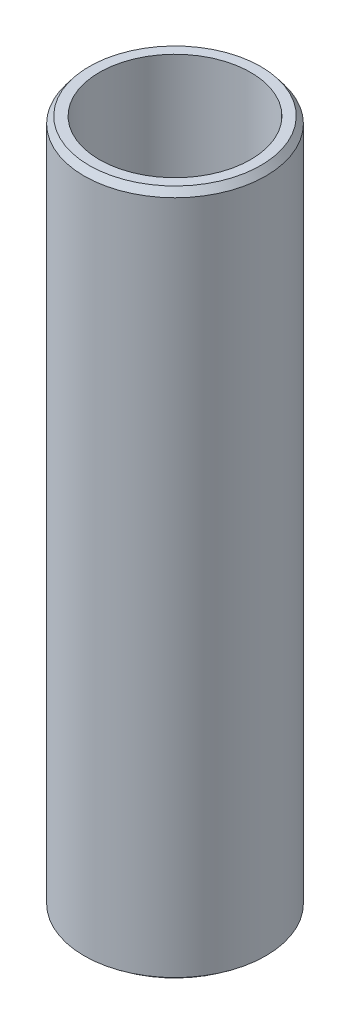
ISO-10303-21;
HEADER;
FILE_DESCRIPTION(('STEP AP214'),'2;1');
FILE_NAME('part.step','',(''),(''),'','','');
FILE_SCHEMA(('AUTOMOTIVE_DESIGN { 1 0 10303 214 1 1 1 1 }'));
ENDSEC;
DATA;
#1=APPLICATION_CONTEXT('core data for automotive mechanical design processes');
#2=APPLICATION_PROTOCOL_DEFINITION('international standard','automotive_design',2000,#1);
#3=PRODUCT_CONTEXT('',#1,'mechanical');
#4=PRODUCT('Part','Part','',(#3));
#5=PRODUCT_RELATED_PRODUCT_CATEGORY('part','',(#4));
#6=PRODUCT_DEFINITION_FORMATION('','',#4);
#7=PRODUCT_DEFINITION_CONTEXT('part definition',#1,'design');
#8=PRODUCT_DEFINITION('design','',#6,#7);
#9=PRODUCT_DEFINITION_SHAPE('','',#8);
#10=(LENGTH_UNIT() NAMED_UNIT(*) SI_UNIT(.MILLI.,.METRE.));
#11=(NAMED_UNIT(*) PLANE_ANGLE_UNIT() SI_UNIT($,.RADIAN.));
#12=(NAMED_UNIT(*) SI_UNIT($,.STERADIAN.) SOLID_ANGLE_UNIT());
#13=UNCERTAINTY_MEASURE_WITH_UNIT(LENGTH_MEASURE(1.E-05),#10,'distance_accuracy_value','');
#14=(GEOMETRIC_REPRESENTATION_CONTEXT(3) GLOBAL_UNCERTAINTY_ASSIGNED_CONTEXT((#13)) GLOBAL_UNIT_ASSIGNED_CONTEXT((#10,
#11,#12)) REPRESENTATION_CONTEXT('',''));
#15=CARTESIAN_POINT('',(0.,0.,0.));
#16=DIRECTION('',(0.,0.,1.));
#17=DIRECTION('',(1.,0.,0.));
#18=AXIS2_PLACEMENT_3D('',#15,#16,#17);
#19=CARTESIAN_POINT('',(0.,264.823582538725,0.));
#20=DIRECTION('',(0.,-1.,0.));
#21=DIRECTION('',(0.,0.,-1.));
#22=AXIS2_PLACEMENT_3D('',#19,#20,#21);
#23=CYLINDRICAL_SURFACE('',#22,35.);
#24=CARTESIAN_POINT('',(0.,262.26969776393,0.));
#25=DIRECTION('',(0.,1.,0.));
#26=DIRECTION('',(0.,0.,1.));
#27=AXIS2_PLACEMENT_3D('',#24,#25,#26);
#28=CIRCLE('',#27,35.);
#29=CARTESIAN_POINT('',(0.,262.26969776393,-35.));
#30=VERTEX_POINT('',#29);
#31=EDGE_CURVE('E50',#30,#30,#28,.F.);
#32=CARTESIAN_POINT('',(0.,1.94213280495031,0.));
#33=DIRECTION('',(0.,1.,0.));
#34=DIRECTION('',(0.,0.,1.));
#35=AXIS2_PLACEMENT_3D('',#32,#33,#34);
#36=CIRCLE('',#35,35.);
#37=CARTESIAN_POINT('',(0.,1.94213280495031,-35.));
#38=VERTEX_POINT('',#37);
#39=EDGE_CURVE('E51',#38,#38,#36,.T.);
#40=CARTESIAN_POINT('',(0.,262.26969776393,-35.));
#41=CARTESIAN_POINT('',(0.,259.557952295607,-35.));
#42=CARTESIAN_POINT('',(0.,256.846206827285,-35.));
#43=CARTESIAN_POINT('',(0.,251.422715890639,-35.));
#44=CARTESIAN_POINT('',(0.,248.710970422317,-35.));
#45=CARTESIAN_POINT('',(0.,243.287479485671,-35.));
#46=CARTESIAN_POINT('',(0.,240.575734017348,-35.));
#47=CARTESIAN_POINT('',(0.,235.152243080703,-35.));
#48=CARTESIAN_POINT('',(0.,232.44049761238,-35.));
#49=CARTESIAN_POINT('',(0.,227.017006675735,-35.));
#50=CARTESIAN_POINT('',(0.,224.305261207412,-35.));
#51=CARTESIAN_POINT('',(0.,218.881770270767,-35.));
#52=CARTESIAN_POINT('',(0.,216.170024802444,-35.));
#53=CARTESIAN_POINT('',(0.,210.746533865799,-35.));
#54=CARTESIAN_POINT('',(0.,208.034788397476,-35.));
#55=CARTESIAN_POINT('',(0.,202.611297460831,-35.));
#56=CARTESIAN_POINT('',(0.,199.899551992508,-35.));
#57=CARTESIAN_POINT('',(0.,194.476061055862,-35.));
#58=CARTESIAN_POINT('',(0.,191.76431558754,-35.));
#59=CARTESIAN_POINT('',(0.,186.340824650894,-35.));
#60=CARTESIAN_POINT('',(0.,183.629079182572,-35.));
#61=CARTESIAN_POINT('',(0.,178.205588245926,-35.));
#62=CARTESIAN_POINT('',(0.,175.493842777604,-35.));
#63=CARTESIAN_POINT('',(0.,170.070351840958,-35.));
#64=CARTESIAN_POINT('',(0.,167.358606372635,-35.));
#65=CARTESIAN_POINT('',(0.,161.93511543599,-35.));
#66=CARTESIAN_POINT('',(0.,159.223369967667,-35.));
#67=CARTESIAN_POINT('',(0.,153.799879031022,-35.));
#68=CARTESIAN_POINT('',(0.,151.088133562699,-35.));
#69=CARTESIAN_POINT('',(0.,145.664642626054,-35.));
#70=CARTESIAN_POINT('',(0.,142.952897157731,-35.));
#71=CARTESIAN_POINT('',(0.,137.529406221086,-35.));
#72=CARTESIAN_POINT('',(0.,134.817660752763,-35.));
#73=CARTESIAN_POINT('',(0.,129.394169816117,-35.));
#74=CARTESIAN_POINT('',(0.,126.682424347795,-35.));
#75=CARTESIAN_POINT('',(0.,121.258933411149,-35.));
#76=CARTESIAN_POINT('',(0.,118.547187942827,-35.));
#77=CARTESIAN_POINT('',(0.,113.123697006181,-35.));
#78=CARTESIAN_POINT('',(0.,110.411951537859,-35.));
#79=CARTESIAN_POINT('',(0.,104.988460601213,-35.));
#80=CARTESIAN_POINT('',(0.,102.27671513289,-35.));
#81=CARTESIAN_POINT('',(0.,96.853224196245,-35.));
#82=CARTESIAN_POINT('',(0.,94.1414787279223,-35.));
#83=CARTESIAN_POINT('',(0.,88.7179877912769,-35.));
#84=CARTESIAN_POINT('',(0.,86.0062423229542,-35.));
#85=CARTESIAN_POINT('',(0.,80.5827513863088,-35.));
#86=CARTESIAN_POINT('',(0.,77.8710059179861,-35.));
#87=CARTESIAN_POINT('',(0.,72.4475149813406,-35.));
#88=CARTESIAN_POINT('',(0.,69.7357695130179,-35.));
#89=CARTESIAN_POINT('',(0.,64.3122785763725,-35.));
#90=CARTESIAN_POINT('',(0.,61.6005331080498,-35.));
#91=CARTESIAN_POINT('',(0.,56.1770421714044,-35.));
#92=CARTESIAN_POINT('',(0.,53.4652967030817,-35.));
#93=CARTESIAN_POINT('',(0.,48.0418057664363,-35.));
#94=CARTESIAN_POINT('',(0.,45.3300602981136,-35.));
#95=CARTESIAN_POINT('',(0.,39.9065693614682,-35.));
#96=CARTESIAN_POINT('',(0.,37.1948238931455,-35.));
#97=CARTESIAN_POINT('',(0.,31.7713329565001,-35.));
#98=CARTESIAN_POINT('',(0.,29.0595874881774,-35.));
#99=CARTESIAN_POINT('',(0.,23.6360965515319,-35.));
#100=CARTESIAN_POINT('',(0.,20.9243510832092,-35.));
#101=CARTESIAN_POINT('',(0.,15.5008601465638,-35.));
#102=CARTESIAN_POINT('',(0.,12.7891146782411,-35.));
#103=CARTESIAN_POINT('',(0.,7.36562374159568,-35.));
#104=CARTESIAN_POINT('',(0.,4.653878273273,-35.));
#105=CARTESIAN_POINT('',(0.,1.94213280495031,-35.));
#106=B_SPLINE_CURVE_WITH_KNOTS('',3,(#40,#41,#42,#43,#44,#45,#46,#47,#48,#49,#50,#51,#52,#53,
#54,#55,#56,#57,#58,#59,#60,#61,#62,#63,#64,#65,#66,#67,#68,#69,#70,#71,#72,#73,#74,#75,#76,#77,
#78,#79,#80,#81,#82,#83,#84,#85,#86,#87,#88,#89,#90,#91,#92,#93,#94,#95,#96,#97,#98,#99,#100,
#101,#102,#103,#104,#105),.UNSPECIFIED.,.F.,.F.,(4,2,2,2,2,2,2,2,2,2,2,2,2,2,2,2,2,2,2,2,2,2,2,
2,2,2,2,2,2,2,2,2,4),(0.,8.1352364049681,16.2704728099362,24.4057092149043,32.5409456198724,
40.6761820248406,48.8114184298087,56.9466548347768,65.0818912397449,73.2171276447131,
81.3523640496812,89.4876004546493,97.6228368596174,105.758073264586,113.893309669554,
122.028546074522,130.16378247949,138.299018884458,146.434255289426,154.569491694394,
162.704728099362,170.83996450433,178.975200909299,187.110437314267,195.245673719235,
203.380910124203,211.516146529171,219.651382934139,227.786619339107,235.921855744075,
244.057092149044,252.192328554012,260.32756495898),.UNSPECIFIED.);
#107=EDGE_CURVE('BSEAM39',#30,#38,#106,.T.);
#108=ORIENTED_EDGE('',*,*,#31,.T.);
#109=ORIENTED_EDGE('',*,*,#39,.T.);
#110=ORIENTED_EDGE('',*,*,#107,.T.);
#111=ORIENTED_EDGE('',*,*,#107,.F.);
#112=EDGE_LOOP('',(#108,#110,#109,#111));
#113=FACE_BOUND('',#112,.T.);
#114=ADVANCED_FACE('F39',(#113),#23,.T.);
#115=CARTESIAN_POINT('',(0.,264.823582538725,0.));
#116=DIRECTION('',(0.,1.,0.));
#117=DIRECTION('',(0.,0.,1.));
#118=AXIS2_PLACEMENT_3D('',#115,#116,#117);
#119=PLANE('',#118);
#120=CARTESIAN_POINT('',(0.,264.823582538725,0.));
#121=DIRECTION('',(0.,1.,0.));
#122=DIRECTION('',(0.,0.,1.));
#123=AXIS2_PLACEMENT_3D('',#120,#121,#122);
#124=CIRCLE('',#123,33.0578671950497);
#125=CARTESIAN_POINT('',(0.,264.823582538725,-33.0578671950497));
#126=VERTEX_POINT('',#125);
#127=EDGE_CURVE('E54',#126,#126,#124,.T.);
#128=ORIENTED_EDGE('',*,*,#127,.T.);
#129=EDGE_LOOP('',(#128));
#130=FACE_BOUND('',#129,.T.);
#131=CARTESIAN_POINT('',(0.,264.823582538725,0.));
#132=DIRECTION('',(0.,1.,0.));
#133=DIRECTION('',(0.,0.,1.));
#134=AXIS2_PLACEMENT_3D('',#131,#132,#133);
#135=CIRCLE('',#134,29.1589473453417);
#136=CARTESIAN_POINT('',(0.,264.823582538725,29.1589473453417));
#137=VERTEX_POINT('',#136);
#138=EDGE_CURVE('E58',#137,#137,#135,.T.);
#139=ORIENTED_EDGE('',*,*,#138,.F.);
#140=EDGE_LOOP('',(#139));
#141=FACE_BOUND('',#140,.T.);
#142=ADVANCED_FACE('F69',(#130,#141),#119,.T.);
#143=CARTESIAN_POINT('',(0.,0.,0.));
#144=DIRECTION('',(0.,1.,0.));
#145=DIRECTION('',(0.,0.,1.));
#146=AXIS2_PLACEMENT_3D('',#143,#144,#145);
#147=PLANE('',#146);
#148=CARTESIAN_POINT('',(0.,0.,0.));
#149=DIRECTION('',(0.,1.,0.));
#150=DIRECTION('',(0.,0.,1.));
#151=AXIS2_PLACEMENT_3D('',#148,#149,#150);
#152=CIRCLE('',#151,32.4461152252048);
#153=CARTESIAN_POINT('',(0.,0.,32.4461152252048));
#154=VERTEX_POINT('',#153);
#155=EDGE_CURVE('E10',#154,#154,#152,.F.);
#156=ORIENTED_EDGE('',*,*,#155,.T.);
#157=EDGE_LOOP('',(#156));
#158=FACE_BOUND('',#157,.T.);
#159=CARTESIAN_POINT('',(0.,0.,0.));
#160=DIRECTION('',(0.,1.,0.));
#161=DIRECTION('',(0.,0.,1.));
#162=AXIS2_PLACEMENT_3D('',#159,#160,#161);
#163=CIRCLE('',#162,29.1589473453417);
#164=CARTESIAN_POINT('',(0.,0.,29.1589473453417));
#165=VERTEX_POINT('',#164);
#166=EDGE_CURVE('E63',#165,#165,#163,.T.);
#167=ORIENTED_EDGE('',*,*,#166,.T.);
#168=EDGE_LOOP('',(#167));
#169=FACE_BOUND('',#168,.T.);
#170=ADVANCED_FACE('F75',(#158,#169),#147,.F.);
#171=CARTESIAN_POINT('',(0.,264.823582538725,0.));
#172=DIRECTION('',(0.,-1.,0.));
#173=DIRECTION('',(0.,0.,-1.));
#174=AXIS2_PLACEMENT_3D('',#171,#172,#173);
#175=CYLINDRICAL_SURFACE('',#174,29.1589473453417);
#176=ORIENTED_EDGE('',*,*,#138,.T.);
#177=EDGE_LOOP('',(#176));
#178=FACE_BOUND('',#177,.T.);
#179=ORIENTED_EDGE('',*,*,#166,.F.);
#180=EDGE_LOOP('',(#179));
#181=FACE_BOUND('',#180,.T.);
#182=ADVANCED_FACE('F70',(#178,#181),#175,.F.);
#183=CARTESIAN_POINT('',(0.,264.823582538725,0.));
#184=DIRECTION('',(0.,-1.,0.));
#185=DIRECTION('',(0.,0.,-1.));
#186=AXIS2_PLACEMENT_3D('',#183,#184,#185);
#187=CONICAL_SURFACE('',#186,33.0578671950497,0.65016335355366);
#188=CARTESIAN_POINT('',(0.,262.26969776393,-35.));
#189=CARTESIAN_POINT('',(0.,262.296300730334,-34.9797694499485));
#190=CARTESIAN_POINT('',(0.,262.322903696738,-34.9595388998969));
#191=CARTESIAN_POINT('',(0.,262.376109629547,-34.9190777997938));
#192=CARTESIAN_POINT('',(0.,262.402712595951,-34.8988472497422));
#193=CARTESIAN_POINT('',(0.,262.455918528759,-34.8583861496391));
#194=CARTESIAN_POINT('',(0.,262.482521495163,-34.8381555995875));
#195=CARTESIAN_POINT('',(0.,262.535727427971,-34.7976944994844));
#196=CARTESIAN_POINT('',(0.,262.562330394375,-34.7774639494328));
#197=CARTESIAN_POINT('',(0.,262.615536327184,-34.7370028493297));
#198=CARTESIAN_POINT('',(0.,262.642139293588,-34.7167722992781));
#199=CARTESIAN_POINT('',(0.,262.695345226396,-34.676311199175));
#200=CARTESIAN_POINT('',(0.,262.7219481928,-34.6560806491234));
#201=CARTESIAN_POINT('',(0.,262.775154125608,-34.6156195490203));
#202=CARTESIAN_POINT('',(0.,262.801757092012,-34.5953889989687));
#203=CARTESIAN_POINT('',(0.,262.854963024821,-34.5549278988656));
#204=CARTESIAN_POINT('',(0.,262.881565991225,-34.534697348814));
#205=CARTESIAN_POINT('',(0.,262.934771924033,-34.4942362487109));
#206=CARTESIAN_POINT('',(0.,262.961374890437,-34.4740056986593));
#207=CARTESIAN_POINT('',(0.,263.014580823245,-34.4335445985562));
#208=CARTESIAN_POINT('',(0.,263.041183789649,-34.4133140485046));
#209=CARTESIAN_POINT('',(0.,263.094389722458,-34.3728529484015));
#210=CARTESIAN_POINT('',(0.,263.120992688862,-34.3526223983499));
#211=CARTESIAN_POINT('',(0.,263.17419862167,-34.3121612982468));
#212=CARTESIAN_POINT('',(0.,263.200801588074,-34.2919307481952));
#213=CARTESIAN_POINT('',(0.,263.254007520882,-34.2514696480921));
#214=CARTESIAN_POINT('',(0.,263.280610487287,-34.2312390980405));
#215=CARTESIAN_POINT('',(0.,263.333816420095,-34.1907779979374));
#216=CARTESIAN_POINT('',(0.,263.360419386499,-34.1705474478859));
#217=CARTESIAN_POINT('',(0.,263.413625319307,-34.1300863477827));
#218=CARTESIAN_POINT('',(0.,263.440228285711,-34.1098557977311));
#219=CARTESIAN_POINT('',(0.,263.493434218519,-34.069394697628));
#220=CARTESIAN_POINT('',(0.,263.520037184924,-34.0491641475765));
#221=CARTESIAN_POINT('',(0.,263.573243117732,-34.0087030474733));
#222=CARTESIAN_POINT('',(0.,263.599846084136,-33.9884724974218));
#223=CARTESIAN_POINT('',(0.,263.653052016944,-33.9480113973186));
#224=CARTESIAN_POINT('',(0.,263.679654983348,-33.927780847267));
#225=CARTESIAN_POINT('',(0.,263.732860916156,-33.8873197471639));
#226=CARTESIAN_POINT('',(0.,263.759463882561,-33.8670891971124));
#227=CARTESIAN_POINT('',(0.,263.812669815369,-33.8266280970092));
#228=CARTESIAN_POINT('',(0.,263.839272781773,-33.8063975469577));
#229=CARTESIAN_POINT('',(0.,263.892478714581,-33.7659364468545));
#230=CARTESIAN_POINT('',(0.,263.919081680985,-33.745705896803));
#231=CARTESIAN_POINT('',(0.,263.972287613794,-33.7052447966998));
#232=CARTESIAN_POINT('',(0.,263.998890580198,-33.6850142466483));
#233=CARTESIAN_POINT('',(0.,264.052096513006,-33.6445531465451));
#234=CARTESIAN_POINT('',(0.,264.07869947941,-33.6243225964936));
#235=CARTESIAN_POINT('',(0.,264.131905412218,-33.5838614963904));
#236=CARTESIAN_POINT('',(0.,264.158508378622,-33.5636309463389));
#237=CARTESIAN_POINT('',(0.,264.211714311431,-33.5231698462358));
#238=CARTESIAN_POINT('',(0.,264.238317277835,-33.5029392961842));
#239=CARTESIAN_POINT('',(0.,264.291523210643,-33.462478196081));
#240=CARTESIAN_POINT('',(0.,264.318126177047,-33.4422476460295));
#241=CARTESIAN_POINT('',(0.,264.371332109855,-33.4017865459263));
#242=CARTESIAN_POINT('',(0.,264.397935076259,-33.3815559958748));
#243=CARTESIAN_POINT('',(0.,264.451141009068,-33.3410948957717));
#244=CARTESIAN_POINT('',(0.,264.477743975472,-33.3208643457201));
#245=CARTESIAN_POINT('',(0.,264.53094990828,-33.280403245617));
#246=CARTESIAN_POINT('',(0.,264.557552874684,-33.2601726955654));
#247=CARTESIAN_POINT('',(0.,264.610758807492,-33.2197115954623));
#248=CARTESIAN_POINT('',(0.,264.637361773897,-33.1994810454107));
#249=CARTESIAN_POINT('',(0.,264.690567706705,-33.1590199453076));
#250=CARTESIAN_POINT('',(0.,264.717170673109,-33.138789395256));
#251=CARTESIAN_POINT('',(0.,264.770376605917,-33.0983282951529));
#252=CARTESIAN_POINT('',(0.,264.796979572321,-33.0780977451013));
#253=CARTESIAN_POINT('',(0.,264.823582538725,-33.0578671950497));
#254=B_SPLINE_CURVE_WITH_KNOTS('',3,(#188,#189,#190,#191,#192,#193,#194,#195,#196,#197,#198,
#199,#200,#201,#202,#203,#204,#205,#206,#207,#208,#209,#210,#211,#212,#213,#214,#215,#216,#217,
#218,#219,#220,#221,#222,#223,#224,#225,#226,#227,#228,#229,#230,#231,#232,#233,#234,#235,#236,
#237,#238,#239,#240,#241,#242,#243,#244,#245,#246,#247,#248,#249,#250,#251,#252,#253),
.UNSPECIFIED.,.F.,.F.,(4,2,2,2,2,2,2,2,2,2,2,2,2,2,2,2,2,2,2,2,2,2,2,2,2,2,2,2,2,2,2,2,4),(0.,
0.100264334596026,0.200528669192052,0.300793003788122,0.401057338384152,0.501321672980178,
0.601586007576248,0.701850342172274,0.802114676768344,0.90237901136437,1.0026433459604,
1.10290768055647,1.2031720151525,1.30343634974852,1.40370068434459,1.50396501894062,
1.60422935353669,1.70449368813272,1.80475802272874,1.90502235732481,2.00528669192084,
2.10555102651687,2.20581536111294,2.30607969570897,2.40634403030504,2.50660836490106,
2.60687269949709,2.70713703409316,2.80740136868918,2.90766570328521,3.00793003788129,
3.10819437247731,3.20845870707338),.UNSPECIFIED.);
#255=EDGE_CURVE('BSEAM81',#30,#126,#254,.T.);
#256=ORIENTED_EDGE('',*,*,#31,.F.);
#257=ORIENTED_EDGE('',*,*,#127,.F.);
#258=ORIENTED_EDGE('',*,*,#255,.T.);
#259=ORIENTED_EDGE('',*,*,#255,.F.);
#260=EDGE_LOOP('',(#256,#258,#257,#259));
#261=FACE_BOUND('',#260,.T.);
#262=ADVANCED_FACE('F81',(#261),#187,.T.);
#263=CARTESIAN_POINT('',(0.,1.94213280495031,0.));
#264=DIRECTION('',(0.,1.,0.));
#265=DIRECTION('',(0.,0.,1.));
#266=AXIS2_PLACEMENT_3D('',#263,#264,#265);
#267=CONICAL_SURFACE('',#266,35.,0.920632973241233);
#268=ORIENTED_EDGE('',*,*,#155,.F.);
#269=EDGE_LOOP('',(#268));
#270=FACE_BOUND('',#269,.T.);
#271=ORIENTED_EDGE('',*,*,#39,.F.);
#272=EDGE_LOOP('',(#271));
#273=FACE_BOUND('',#272,.T.);
#274=ADVANCED_FACE('F45',(#270,#273),#267,.T.);
#275=CLOSED_SHELL('',(#114,#142,#170,#182,#262,#274));
#276=MANIFOLD_SOLID_BREP('B2',#275);
#277=ADVANCED_BREP_SHAPE_REPRESENTATION('',(#18,#276),#14);
#278=SHAPE_DEFINITION_REPRESENTATION(#9,#277);
ENDSEC;
END-ISO-10303-21;
